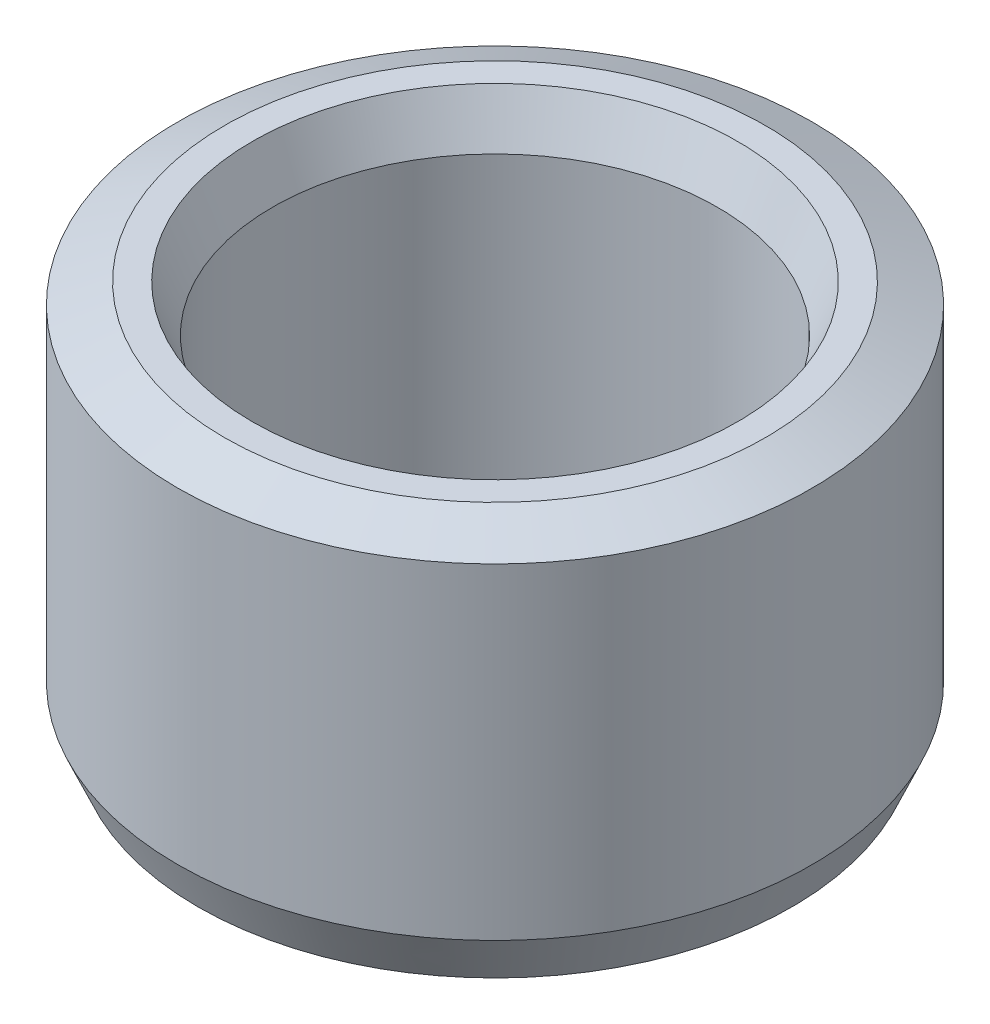
ISO-10303-21;
HEADER;
FILE_DESCRIPTION(('STEP AP214'),'2;1');
FILE_NAME('part.step','',(''),(''),'','','');
FILE_SCHEMA(('AUTOMOTIVE_DESIGN { 1 0 10303 214 1 1 1 1 }'));
ENDSEC;
DATA;
#1=APPLICATION_CONTEXT('core data for automotive mechanical design processes');
#2=APPLICATION_PROTOCOL_DEFINITION('international standard','automotive_design',2000,#1);
#3=PRODUCT_CONTEXT('',#1,'mechanical');
#4=PRODUCT('Part','Part','',(#3));
#5=PRODUCT_RELATED_PRODUCT_CATEGORY('part','',(#4));
#6=PRODUCT_DEFINITION_FORMATION('','',#4);
#7=PRODUCT_DEFINITION_CONTEXT('part definition',#1,'design');
#8=PRODUCT_DEFINITION('design','',#6,#7);
#9=PRODUCT_DEFINITION_SHAPE('','',#8);
#10=(LENGTH_UNIT() NAMED_UNIT(*) SI_UNIT(.MILLI.,.METRE.));
#11=(NAMED_UNIT(*) PLANE_ANGLE_UNIT() SI_UNIT($,.RADIAN.));
#12=(NAMED_UNIT(*) SI_UNIT($,.STERADIAN.) SOLID_ANGLE_UNIT());
#13=UNCERTAINTY_MEASURE_WITH_UNIT(LENGTH_MEASURE(1.E-05),#10,'distance_accuracy_value','');
#14=(GEOMETRIC_REPRESENTATION_CONTEXT(3) GLOBAL_UNCERTAINTY_ASSIGNED_CONTEXT((#13)) GLOBAL_UNIT_ASSIGNED_CONTEXT((#10,
#11,#12)) REPRESENTATION_CONTEXT('',''));
#15=CARTESIAN_POINT('',(0.,0.,0.));
#16=DIRECTION('',(0.,0.,1.));
#17=DIRECTION('',(1.,0.,0.));
#18=AXIS2_PLACEMENT_3D('',#15,#16,#17);
#19=CARTESIAN_POINT('',(0.,46.4748190328206,0.));
#20=DIRECTION('',(0.,-1.,0.));
#21=DIRECTION('',(0.,0.,-1.));
#22=AXIS2_PLACEMENT_3D('',#19,#20,#21);
#23=CYLINDRICAL_SURFACE('',#22,37.5);
#24=CARTESIAN_POINT('',(0.,5.53193124484951,0.));
#25=DIRECTION('',(0.,1.,0.));
#26=DIRECTION('',(0.,0.,1.));
#27=AXIS2_PLACEMENT_3D('',#24,#25,#26);
#28=CIRCLE('',#27,37.5);
#29=CARTESIAN_POINT('',(0.,5.5319312448495,37.5));
#30=VERTEX_POINT('',#29);
#31=EDGE_CURVE('E10',#30,#30,#28,.T.);
#32=ORIENTED_EDGE('',*,*,#31,.T.);
#33=EDGE_LOOP('',(#32));
#34=FACE_BOUND('',#33,.T.);
#35=CARTESIAN_POINT('',(0.,44.0781751213033,0.));
#36=DIRECTION('',(0.,1.,0.));
#37=DIRECTION('',(0.,0.,1.));
#38=AXIS2_PLACEMENT_3D('',#35,#36,#37);
#39=CIRCLE('',#38,37.5);
#40=CARTESIAN_POINT('',(0.,44.0781751213033,37.5));
#41=VERTEX_POINT('',#40);
#42=EDGE_CURVE('E50',#41,#41,#39,.F.);
#43=ORIENTED_EDGE('',*,*,#42,.T.);
#44=EDGE_LOOP('',(#43));
#45=FACE_BOUND('',#44,.T.);
#46=ADVANCED_FACE('F39',(#34,#45),#23,.T.);
#47=CARTESIAN_POINT('',(0.,46.4748190328206,0.));
#48=DIRECTION('',(0.,1.,0.));
#49=DIRECTION('',(0.,0.,1.));
#50=AXIS2_PLACEMENT_3D('',#47,#48,#49);
#51=PLANE('',#50);
#52=CARTESIAN_POINT('',(0.,46.4748190328206,0.));
#53=DIRECTION('',(0.,1.,0.));
#54=DIRECTION('',(0.,0.,1.));
#55=AXIS2_PLACEMENT_3D('',#52,#53,#54);
#56=CIRCLE('',#55,28.6971405754086);
#57=CARTESIAN_POINT('',(0.,46.4748190328206,28.6971405754086));
#58=VERTEX_POINT('',#57);
#59=EDGE_CURVE('E58',#58,#58,#56,.F.);
#60=ORIENTED_EDGE('',*,*,#59,.T.);
#61=EDGE_LOOP('',(#60));
#62=FACE_BOUND('',#61,.T.);
#63=CARTESIAN_POINT('',(0.,46.4748190328206,0.));
#64=DIRECTION('',(0.,1.,0.));
#65=DIRECTION('',(0.,0.,1.));
#66=AXIS2_PLACEMENT_3D('',#63,#64,#65);
#67=CIRCLE('',#66,31.9680687551504);
#68=CARTESIAN_POINT('',(0.,46.4748190328206,31.9680687551504));
#69=VERTEX_POINT('',#68);
#70=EDGE_CURVE('E61',#69,#69,#67,.T.);
#71=ORIENTED_EDGE('',*,*,#70,.T.);
#72=EDGE_LOOP('',(#71));
#73=FACE_BOUND('',#72,.T.);
#74=ADVANCED_FACE('F88',(#62,#73),#51,.T.);
#75=CARTESIAN_POINT('',(0.,0.,0.));
#76=DIRECTION('',(0.,1.,0.));
#77=DIRECTION('',(0.,0.,1.));
#78=AXIS2_PLACEMENT_3D('',#75,#76,#77);
#79=PLANE('',#78);
#80=CARTESIAN_POINT('',(0.,0.,0.));
#81=DIRECTION('',(0.,1.,0.));
#82=DIRECTION('',(0.,0.,1.));
#83=AXIS2_PLACEMENT_3D('',#80,#81,#82);
#84=CIRCLE('',#83,31.8324279087409);
#85=CARTESIAN_POINT('',(0.,0.,31.8324279087409));
#86=VERTEX_POINT('',#85);
#87=EDGE_CURVE('E51',#86,#86,#84,.T.);
#88=ORIENTED_EDGE('',*,*,#87,.T.);
#89=EDGE_LOOP('',(#88));
#90=FACE_BOUND('',#89,.T.);
#91=CARTESIAN_POINT('',(0.,0.,0.));
#92=DIRECTION('',(0.,1.,0.));
#93=DIRECTION('',(0.,0.,1.));
#94=AXIS2_PLACEMENT_3D('',#91,#92,#93);
#95=CIRCLE('',#94,35.1033560884828);
#96=CARTESIAN_POINT('',(0.,0.,35.1033560884828));
#97=VERTEX_POINT('',#96);
#98=EDGE_CURVE('E54',#97,#97,#95,.F.);
#99=ORIENTED_EDGE('',*,*,#98,.T.);
#100=EDGE_LOOP('',(#99));
#101=FACE_BOUND('',#100,.T.);
#102=ADVANCED_FACE('F83',(#90,#101),#79,.F.);
#103=CARTESIAN_POINT('',(0.,46.4748190328206,0.));
#104=DIRECTION('',(0.,-1.,0.));
#105=DIRECTION('',(0.,0.,-1.));
#106=AXIS2_PLACEMENT_3D('',#103,#104,#105);
#107=CYLINDRICAL_SURFACE('',#106,26.3004966638913);
#108=CARTESIAN_POINT('',(0.,40.9428877879709,0.));
#109=DIRECTION('',(0.,1.,0.));
#110=DIRECTION('',(0.,0.,1.));
#111=AXIS2_PLACEMENT_3D('',#108,#109,#110);
#112=CIRCLE('',#111,26.3004966638913);
#113=CARTESIAN_POINT('',(0.,40.9428877879709,26.3004966638913));
#114=VERTEX_POINT('',#113);
#115=EDGE_CURVE('E67',#114,#114,#112,.T.);
#116=ORIENTED_EDGE('',*,*,#115,.T.);
#117=EDGE_LOOP('',(#116));
#118=FACE_BOUND('',#117,.T.);
#119=CARTESIAN_POINT('',(0.,2.39664391151724,0.));
#120=DIRECTION('',(0.,1.,0.));
#121=DIRECTION('',(0.,0.,1.));
#122=AXIS2_PLACEMENT_3D('',#119,#120,#121);
#123=CIRCLE('',#122,26.3004966638913);
#124=CARTESIAN_POINT('',(0.,2.39664391151724,26.3004966638913));
#125=VERTEX_POINT('',#124);
#126=EDGE_CURVE('E69',#125,#125,#123,.F.);
#127=ORIENTED_EDGE('',*,*,#126,.T.);
#128=EDGE_LOOP('',(#127));
#129=FACE_BOUND('',#128,.T.);
#130=ADVANCED_FACE('F71',(#118,#129),#107,.F.);
#131=CARTESIAN_POINT('',(0.,40.9428877879709,0.));
#132=DIRECTION('',(0.,1.,0.));
#133=DIRECTION('',(0.,0.,1.));
#134=AXIS2_PLACEMENT_3D('',#131,#132,#133);
#135=CONICAL_SURFACE('',#134,26.3004966638913,0.40882772904525);
#136=ORIENTED_EDGE('',*,*,#59,.F.);
#137=EDGE_LOOP('',(#136));
#138=FACE_BOUND('',#137,.T.);
#139=ORIENTED_EDGE('',*,*,#115,.F.);
#140=EDGE_LOOP('',(#139));
#141=FACE_BOUND('',#140,.T.);
#142=ADVANCED_FACE('F77',(#138,#141),#135,.F.);
#143=CARTESIAN_POINT('',(0.,0.,0.));
#144=DIRECTION('',(0.,-1.,0.));
#145=DIRECTION('',(0.,0.,-1.));
#146=AXIS2_PLACEMENT_3D('',#143,#144,#145);
#147=CONICAL_SURFACE('',#146,31.8324279087409,1.16196859774965);
#148=ORIENTED_EDGE('',*,*,#126,.F.);
#149=EDGE_LOOP('',(#148));
#150=FACE_BOUND('',#149,.T.);
#151=ORIENTED_EDGE('',*,*,#87,.F.);
#152=EDGE_LOOP('',(#151));
#153=FACE_BOUND('',#152,.T.);
#154=ADVANCED_FACE('F73',(#150,#153),#147,.F.);
#155=CARTESIAN_POINT('',(0.,5.53193124484951,0.));
#156=DIRECTION('',(0.,1.,0.));
#157=DIRECTION('',(0.,0.,1.));
#158=AXIS2_PLACEMENT_3D('',#155,#156,#157);
#159=CONICAL_SURFACE('',#158,37.5,0.408827729045252);
#160=CARTESIAN_POINT('',(0.,0.,35.1033560884828));
#161=CARTESIAN_POINT('',(0.,0.0576242838005137,35.1283211292278));
#162=CARTESIAN_POINT('',(0.,0.11524856760103,35.1532861699727));
#163=CARTESIAN_POINT('',(0.,0.230497135202062,35.2032162514627));
#164=CARTESIAN_POINT('',(0.,0.288121419002578,35.2281812922076));
#165=CARTESIAN_POINT('',(0.,0.40336998660361,35.2781113736976));
#166=CARTESIAN_POINT('',(0.,0.460994270404125,35.3030764144426));
#167=CARTESIAN_POINT('',(0.,0.576242838005156,35.3530064959325));
#168=CARTESIAN_POINT('',(0.,0.633867121805672,35.3779715366775));
#169=CARTESIAN_POINT('',(0.,0.749115689406703,35.4279016181674));
#170=CARTESIAN_POINT('',(0.,0.806739973207218,35.4528666589124));
#171=CARTESIAN_POINT('',(0.,0.92198854080825,35.5027967404023));
#172=CARTESIAN_POINT('',(0.,0.979612824608766,35.5277617811473));
#173=CARTESIAN_POINT('',(0.,1.0948613922098,35.5776918626372));
#174=CARTESIAN_POINT('',(0.,1.15248567601031,35.6026569033822));
#175=CARTESIAN_POINT('',(0.,1.26773424361134,35.6525869848722));
#176=CARTESIAN_POINT('',(0.,1.32535852741186,35.6775520256171));
#177=CARTESIAN_POINT('',(0.,1.44060709501289,35.7274821071071));
#178=CARTESIAN_POINT('',(0.,1.49823137881341,35.752447147852));
#179=CARTESIAN_POINT('',(0.,1.61347994641444,35.802377229342));
#180=CARTESIAN_POINT('',(0.,1.67110423021495,35.8273422700869));
#181=CARTESIAN_POINT('',(0.,1.78635279781598,35.8772723515769));
#182=CARTESIAN_POINT('',(0.,1.8439770816165,35.9022373923219));
#183=CARTESIAN_POINT('',(0.,1.95922564921753,35.9521674738118));
#184=CARTESIAN_POINT('',(0.,2.01684993301805,35.9771325145568));
#185=CARTESIAN_POINT('',(0.,2.13209850061908,36.0270625960467));
#186=CARTESIAN_POINT('',(0.,2.1897227844196,36.0520276367917));
#187=CARTESIAN_POINT('',(0.,2.30497135202063,36.1019577182816));
#188=CARTESIAN_POINT('',(0.,2.36259563582114,36.1269227590266));
#189=CARTESIAN_POINT('',(0.,2.47784420342217,36.1768528405165));
#190=CARTESIAN_POINT('',(0.,2.53546848722269,36.2018178812615));
#191=CARTESIAN_POINT('',(0.,2.65071705482372,36.2517479627515));
#192=CARTESIAN_POINT('',(0.,2.70834133862424,36.2767130034964));
#193=CARTESIAN_POINT('',(0.,2.82358990622527,36.3266430849864));
#194=CARTESIAN_POINT('',(0.,2.88121419002578,36.3516081257313));
#195=CARTESIAN_POINT('',(0.,2.99646275762681,36.4015382072213));
#196=CARTESIAN_POINT('',(0.,3.05408704142733,36.4265032479663));
#197=CARTESIAN_POINT('',(0.,3.16933560902836,36.4764333294562));
#198=CARTESIAN_POINT('',(0.,3.22695989282888,36.5013983702012));
#199=CARTESIAN_POINT('',(0.,3.34220846042991,36.5513284516911));
#200=CARTESIAN_POINT('',(0.,3.39983274423042,36.5762934924361));
#201=CARTESIAN_POINT('',(0.,3.51508131183146,36.626223573926));
#202=CARTESIAN_POINT('',(0.,3.57270559563197,36.651188614671));
#203=CARTESIAN_POINT('',(0.,3.687954163233,36.7011186961609));
#204=CARTESIAN_POINT('',(0.,3.74557844703352,36.7260837369059));
#205=CARTESIAN_POINT('',(0.,3.86082701463455,36.7760138183958));
#206=CARTESIAN_POINT('',(0.,3.91845129843507,36.8009788591408));
#207=CARTESIAN_POINT('',(0.,4.0336998660361,36.8509089406308));
#208=CARTESIAN_POINT('',(0.,4.09132414983661,36.8758739813757));
#209=CARTESIAN_POINT('',(0.,4.20657271743764,36.9258040628657));
#210=CARTESIAN_POINT('',(0.,4.26419700123816,36.9507691036106));
#211=CARTESIAN_POINT('',(0.,4.37944556883919,37.0006991851006));
#212=CARTESIAN_POINT('',(0.,4.43706985263971,37.0256642258456));
#213=CARTESIAN_POINT('',(0.,4.55231842024074,37.0755943073355));
#214=CARTESIAN_POINT('',(0.,4.60994270404125,37.1005593480805));
#215=CARTESIAN_POINT('',(0.,4.72519127164229,37.1504894295704));
#216=CARTESIAN_POINT('',(0.,4.7828155554428,37.1754544703154));
#217=CARTESIAN_POINT('',(0.,4.89806412304383,37.2253845518053));
#218=CARTESIAN_POINT('',(0.,4.95568840684435,37.2503495925503));
#219=CARTESIAN_POINT('',(0.,5.07093697444538,37.3002796740402));
#220=CARTESIAN_POINT('',(0.,5.12856125824589,37.3252447147852));
#221=CARTESIAN_POINT('',(0.,5.24380982584693,37.3751747962752));
#222=CARTESIAN_POINT('',(0.,5.30143410964744,37.4001398370201));
#223=CARTESIAN_POINT('',(0.,5.41668267724847,37.4500699185101));
#224=CARTESIAN_POINT('',(0.,5.47430696104899,37.475034959255));
#225=CARTESIAN_POINT('',(0.,5.5319312448495,37.5));
#226=B_SPLINE_CURVE_WITH_KNOTS('',3,(#160,#161,#162,#163,#164,#165,#166,#167,#168,#169,#170,
#171,#172,#173,#174,#175,#176,#177,#178,#179,#180,#181,#182,#183,#184,#185,#186,#187,#188,#189,
#190,#191,#192,#193,#194,#195,#196,#197,#198,#199,#200,#201,#202,#203,#204,#205,#206,#207,#208,
#209,#210,#211,#212,#213,#214,#215,#216,#217,#218,#219,#220,#221,#222,#223,#224,#225),
.UNSPECIFIED.,.F.,.F.,(4,2,2,2,2,2,2,2,2,2,2,2,2,2,2,2,2,2,2,2,2,2,2,2,2,2,2,2,2,2,2,2,4),(0.,
0.188399315514373,0.376798631028743,0.565197946543116,0.753597262057489,0.941996577571862,
1.13039589308623,1.31879520860061,1.50719452411498,1.69559383962935,1.88399315514372,
2.07239247065809,2.26079178617247,2.44919110168684,2.63759041720121,2.82598973271558,
3.01438904822995,3.20278836374433,3.3911876792587,3.57958699477307,3.76798631028744,
3.95638562580181,4.14478494131619,4.33318425683056,4.52158357234493,4.7099828878593,
4.89838220337368,5.08678151888804,5.27518083440242,5.46358014991679,5.65197946543116,
5.84037878094553,6.02877809645991),.UNSPECIFIED.);
#227=EDGE_CURVE('BSEAM76',#97,#30,#226,.T.);
#228=ORIENTED_EDGE('',*,*,#98,.F.);
#229=ORIENTED_EDGE('',*,*,#31,.F.);
#230=ORIENTED_EDGE('',*,*,#227,.T.);
#231=ORIENTED_EDGE('',*,*,#227,.F.);
#232=EDGE_LOOP('',(#228,#230,#229,#231));
#233=FACE_BOUND('',#232,.T.);
#234=ADVANCED_FACE('F76',(#233),#159,.T.);
#235=CARTESIAN_POINT('',(0.,46.4748190328206,0.));
#236=DIRECTION('',(0.,-1.,0.));
#237=DIRECTION('',(0.,0.,-1.));
#238=AXIS2_PLACEMENT_3D('',#235,#236,#237);
#239=CONICAL_SURFACE('',#238,31.9680687551504,1.16196859774965);
#240=ORIENTED_EDGE('',*,*,#42,.F.);
#241=EDGE_LOOP('',(#240));
#242=FACE_BOUND('',#241,.T.);
#243=ORIENTED_EDGE('',*,*,#70,.F.);
#244=EDGE_LOOP('',(#243));
#245=FACE_BOUND('',#244,.T.);
#246=ADVANCED_FACE('F45',(#242,#245),#239,.T.);
#247=CLOSED_SHELL('',(#46,#74,#102,#130,#142,#154,#234,#246));
#248=MANIFOLD_SOLID_BREP('B2',#247);
#249=ADVANCED_BREP_SHAPE_REPRESENTATION('',(#18,#248),#14);
#250=SHAPE_DEFINITION_REPRESENTATION(#9,#249);
ENDSEC;
END-ISO-10303-21;
